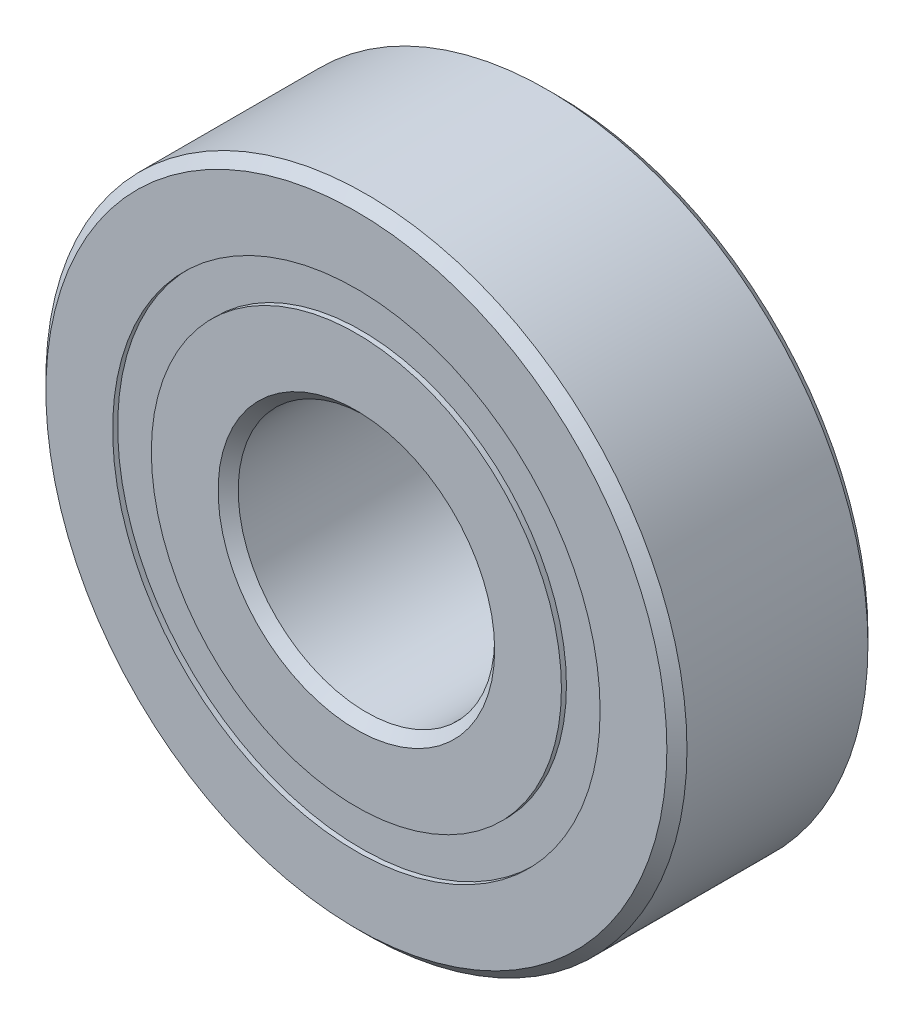
ISO-10303-21;
HEADER;
FILE_DESCRIPTION(('STEP AP214'),'2;1');
FILE_NAME('part.step','',(''),(''),'','','');
FILE_SCHEMA(('AUTOMOTIVE_DESIGN { 1 0 10303 214 1 1 1 1 }'));
ENDSEC;
DATA;
#1=APPLICATION_CONTEXT('core data for automotive mechanical design processes');
#2=APPLICATION_PROTOCOL_DEFINITION('international standard','automotive_design',2000,#1);
#3=PRODUCT_CONTEXT('',#1,'mechanical');
#4=PRODUCT('Part','Part','',(#3));
#5=PRODUCT_RELATED_PRODUCT_CATEGORY('part','',(#4));
#6=PRODUCT_DEFINITION_FORMATION('','',#4);
#7=PRODUCT_DEFINITION_CONTEXT('part definition',#1,'design');
#8=PRODUCT_DEFINITION('design','',#6,#7);
#9=PRODUCT_DEFINITION_SHAPE('','',#8);
#10=(LENGTH_UNIT() NAMED_UNIT(*) SI_UNIT(.MILLI.,.METRE.));
#11=(NAMED_UNIT(*) PLANE_ANGLE_UNIT() SI_UNIT($,.RADIAN.));
#12=(NAMED_UNIT(*) SI_UNIT($,.STERADIAN.) SOLID_ANGLE_UNIT());
#13=UNCERTAINTY_MEASURE_WITH_UNIT(LENGTH_MEASURE(1.E-05),#10,'distance_accuracy_value','');
#14=(GEOMETRIC_REPRESENTATION_CONTEXT(3) GLOBAL_UNCERTAINTY_ASSIGNED_CONTEXT((#13)) GLOBAL_UNIT_ASSIGNED_CONTEXT((#10,
#11,#12)) REPRESENTATION_CONTEXT('',''));
#15=CARTESIAN_POINT('',(0.,0.,0.));
#16=DIRECTION('',(0.,0.,1.));
#17=DIRECTION('',(1.,0.,0.));
#18=AXIS2_PLACEMENT_3D('',#15,#16,#17);
#19=CARTESIAN_POINT('',(0.,6.03522142857143,-2.36474));
#20=DIRECTION('',(0.,0.,1.));
#21=DIRECTION('',(1.,0.,0.));
#22=AXIS2_PLACEMENT_3D('',#19,#20,#21);
#23=PLANE('',#22);
#24=CARTESIAN_POINT('',(0.,0.,-2.36474));
#25=DIRECTION('',(0.,0.,1.));
#26=DIRECTION('',(1.,0.,0.));
#27=AXIS2_PLACEMENT_3D('',#24,#25,#26);
#28=CIRCLE('',#27,6.03522142857143);
#29=CARTESIAN_POINT('',(6.03522142857143,0.,-2.36474));
#30=VERTEX_POINT('',#29);
#31=EDGE_CURVE('E70',#30,#30,#28,.T.);
#32=ORIENTED_EDGE('',*,*,#31,.F.);
#33=EDGE_LOOP('',(#32));
#34=FACE_BOUND('',#33,.T.);
#35=CARTESIAN_POINT('',(0.,0.,-2.36474));
#36=DIRECTION('',(0.,0.,1.));
#37=DIRECTION('',(1.,0.,0.));
#38=AXIS2_PLACEMENT_3D('',#35,#36,#37);
#39=CIRCLE('',#38,5.07727857142857);
#40=CARTESIAN_POINT('',(5.07727857142857,0.,-2.36474));
#41=VERTEX_POINT('',#40);
#42=EDGE_CURVE('E11',#41,#41,#39,.T.);
#43=ORIENTED_EDGE('',*,*,#42,.T.);
#44=EDGE_LOOP('',(#43));
#45=FACE_BOUND('',#44,.T.);
#46=ADVANCED_FACE('F56',(#34,#45),#23,.F.);
#47=CARTESIAN_POINT('',(0.,0.,2.4892));
#48=DIRECTION('',(0.,0.,1.));
#49=DIRECTION('',(1.,0.,0.));
#50=AXIS2_PLACEMENT_3D('',#47,#48,#49);
#51=CYLINDRICAL_SURFACE('',#50,5.07727857142857);
#52=ORIENTED_EDGE('',*,*,#42,.F.);
#53=EDGE_LOOP('',(#52));
#54=FACE_BOUND('',#53,.T.);
#55=CARTESIAN_POINT('',(0.,0.,-1.20554465033679));
#56=DIRECTION('',(0.,0.,1.));
#57=DIRECTION('',(1.,0.,0.));
#58=AXIS2_PLACEMENT_3D('',#55,#56,#57);
#59=CIRCLE('',#58,5.07727857142857);
#60=CARTESIAN_POINT('',(5.07727857142857,0.,-1.20554465033679));
#61=VERTEX_POINT('',#60);
#62=EDGE_CURVE('E62',#61,#61,#59,.T.);
#63=ORIENTED_EDGE('',*,*,#62,.T.);
#64=EDGE_LOOP('',(#63));
#65=FACE_BOUND('',#64,.T.);
#66=ADVANCED_FACE('F79',(#54,#65),#51,.F.);
#67=CARTESIAN_POINT('',(0.,6.03522142857143,-1.20554465033679));
#68=DIRECTION('',(0.,0.,-1.));
#69=DIRECTION('',(-1.,0.,0.));
#70=AXIS2_PLACEMENT_3D('',#67,#68,#69);
#71=PLANE('',#70);
#72=ORIENTED_EDGE('',*,*,#62,.F.);
#73=EDGE_LOOP('',(#72));
#74=FACE_BOUND('',#73,.T.);
#75=CARTESIAN_POINT('',(0.,0.,-1.20554465033679));
#76=DIRECTION('',(0.,0.,1.));
#77=DIRECTION('',(1.,0.,0.));
#78=AXIS2_PLACEMENT_3D('',#75,#76,#77);
#79=CIRCLE('',#78,6.03522142857143);
#80=CARTESIAN_POINT('',(6.03522142857143,0.,-1.20554465033679));
#81=VERTEX_POINT('',#80);
#82=EDGE_CURVE('E66',#81,#81,#79,.T.);
#83=ORIENTED_EDGE('',*,*,#82,.T.);
#84=EDGE_LOOP('',(#83));
#85=FACE_BOUND('',#84,.T.);
#86=ADVANCED_FACE('F83',(#74,#85),#71,.F.);
#87=CARTESIAN_POINT('',(0.,0.,2.4892));
#88=DIRECTION('',(0.,0.,1.));
#89=DIRECTION('',(1.,0.,0.));
#90=AXIS2_PLACEMENT_3D('',#87,#88,#89);
#91=CYLINDRICAL_SURFACE('',#90,6.03522142857143);
#92=ORIENTED_EDGE('',*,*,#82,.F.);
#93=EDGE_LOOP('',(#92));
#94=FACE_BOUND('',#93,.T.);
#95=ORIENTED_EDGE('',*,*,#31,.T.);
#96=EDGE_LOOP('',(#95));
#97=FACE_BOUND('',#96,.T.);
#98=ADVANCED_FACE('F76',(#94,#97),#91,.T.);
#99=CLOSED_SHELL('',(#46,#66,#86,#98));
#100=MANIFOLD_SOLID_BREP('B2',#99);
#101=CARTESIAN_POINT('',(0.,6.03522142857143,2.36474));
#102=DIRECTION('',(0.,0.,-1.));
#103=DIRECTION('',(-1.,0.,0.));
#104=AXIS2_PLACEMENT_3D('',#101,#102,#103);
#105=PLANE('',#104);
#106=CARTESIAN_POINT('',(0.,0.,2.36474));
#107=DIRECTION('',(0.,0.,1.));
#108=DIRECTION('',(1.,0.,0.));
#109=AXIS2_PLACEMENT_3D('',#106,#107,#108);
#110=CIRCLE('',#109,5.07727857142857);
#111=CARTESIAN_POINT('',(5.07727857142857,0.,2.36474));
#112=VERTEX_POINT('',#111);
#113=EDGE_CURVE('E55',#112,#112,#110,.T.);
#114=ORIENTED_EDGE('',*,*,#113,.F.);
#115=EDGE_LOOP('',(#114));
#116=FACE_BOUND('',#115,.T.);
#117=CARTESIAN_POINT('',(0.,0.,2.36474));
#118=DIRECTION('',(0.,0.,1.));
#119=DIRECTION('',(1.,0.,0.));
#120=AXIS2_PLACEMENT_3D('',#117,#118,#119);
#121=CIRCLE('',#120,6.03522142857143);
#122=CARTESIAN_POINT('',(6.03522142857143,0.,2.36474));
#123=VERTEX_POINT('',#122);
#124=EDGE_CURVE('E146',#123,#123,#121,.T.);
#125=ORIENTED_EDGE('',*,*,#124,.T.);
#126=EDGE_LOOP('',(#125));
#127=FACE_BOUND('',#126,.T.);
#128=ADVANCED_FACE('F132',(#116,#127),#105,.F.);
#129=CARTESIAN_POINT('',(0.,0.,2.4892));
#130=DIRECTION('',(0.,0.,1.));
#131=DIRECTION('',(1.,0.,0.));
#132=AXIS2_PLACEMENT_3D('',#129,#130,#131);
#133=CYLINDRICAL_SURFACE('',#132,5.07727857142857);
#134=CARTESIAN_POINT('',(0.,0.,1.20554465033679));
#135=DIRECTION('',(0.,0.,1.));
#136=DIRECTION('',(1.,0.,0.));
#137=AXIS2_PLACEMENT_3D('',#134,#135,#136);
#138=CIRCLE('',#137,5.07727857142857);
#139=CARTESIAN_POINT('',(5.07727857142857,0.,1.20554465033679));
#140=VERTEX_POINT('',#139);
#141=EDGE_CURVE('E138',#140,#140,#138,.T.);
#142=ORIENTED_EDGE('',*,*,#141,.F.);
#143=EDGE_LOOP('',(#142));
#144=FACE_BOUND('',#143,.T.);
#145=ORIENTED_EDGE('',*,*,#113,.T.);
#146=EDGE_LOOP('',(#145));
#147=FACE_BOUND('',#146,.T.);
#148=ADVANCED_FACE('F161',(#144,#147),#133,.F.);
#149=CARTESIAN_POINT('',(0.,6.03522142857143,1.20554465033679));
#150=DIRECTION('',(0.,0.,1.));
#151=DIRECTION('',(1.,0.,0.));
#152=AXIS2_PLACEMENT_3D('',#149,#150,#151);
#153=PLANE('',#152);
#154=CARTESIAN_POINT('',(0.,0.,1.20554465033679));
#155=DIRECTION('',(0.,0.,1.));
#156=DIRECTION('',(1.,0.,0.));
#157=AXIS2_PLACEMENT_3D('',#154,#155,#156);
#158=CIRCLE('',#157,6.03522142857143);
#159=CARTESIAN_POINT('',(6.03522142857143,0.,1.20554465033679));
#160=VERTEX_POINT('',#159);
#161=EDGE_CURVE('E142',#160,#160,#158,.T.);
#162=ORIENTED_EDGE('',*,*,#161,.F.);
#163=EDGE_LOOP('',(#162));
#164=FACE_BOUND('',#163,.T.);
#165=ORIENTED_EDGE('',*,*,#141,.T.);
#166=EDGE_LOOP('',(#165));
#167=FACE_BOUND('',#166,.T.);
#168=ADVANCED_FACE('F156',(#164,#167),#153,.F.);
#169=CARTESIAN_POINT('',(0.,0.,2.4892));
#170=DIRECTION('',(0.,0.,1.));
#171=DIRECTION('',(1.,0.,0.));
#172=AXIS2_PLACEMENT_3D('',#169,#170,#171);
#173=CYLINDRICAL_SURFACE('',#172,6.03522142857143);
#174=ORIENTED_EDGE('',*,*,#124,.F.);
#175=EDGE_LOOP('',(#174));
#176=FACE_BOUND('',#175,.T.);
#177=ORIENTED_EDGE('',*,*,#161,.T.);
#178=EDGE_LOOP('',(#177));
#179=FACE_BOUND('',#178,.T.);
#180=ADVANCED_FACE('F153',(#176,#179),#173,.T.);
#181=CLOSED_SHELL('',(#128,#148,#168,#180));
#182=MANIFOLD_SOLID_BREP('B6',#181);
#183=CARTESIAN_POINT('',(-3.26588180805,4.49510067499584,0.));
#184=DIRECTION('',(0.,0.,1.));
#185=DIRECTION('',(-0.587785252292462,0.809016994374955,0.));
#186=AXIS2_PLACEMENT_3D('',#183,#184,#185);
#187=SPHERICAL_SURFACE('',#186,1.20554465033679);
#188=CARTESIAN_POINT('',(-3.26588180805,4.49510067499584,1.20554465033679));
#189=VERTEX_POINT('',#188);
#190=VERTEX_LOOP('',#189);
#191=FACE_BOUND('',#190,.T.);
#192=ADVANCED_FACE('F208',(#191),#187,.T.);
#193=CLOSED_SHELL('',(#192));
#194=MANIFOLD_SOLID_BREP('B50',#193);
#195=CARTESIAN_POINT('',(-5.28430776866493,1.71697567499586,0.));
#196=DIRECTION('',(0.,0.,1.));
#197=DIRECTION('',(-0.95105651629515,0.309016994374958,0.));
#198=AXIS2_PLACEMENT_3D('',#195,#196,#197);
#199=SPHERICAL_SURFACE('',#198,1.20554465033679);
#200=CARTESIAN_POINT('',(-5.28430776866493,1.71697567499586,1.20554465033679));
#201=VERTEX_POINT('',#200);
#202=VERTEX_LOOP('',#201);
#203=FACE_BOUND('',#202,.T.);
#204=ADVANCED_FACE('F231',(#203),#199,.T.);
#205=CLOSED_SHELL('',(#204));
#206=MANIFOLD_SOLID_BREP('B128',#205);
#207=CARTESIAN_POINT('',(-5.28430776866496,-1.71697567499575,0.));
#208=DIRECTION('',(0.,0.,1.));
#209=DIRECTION('',(-0.951056516295157,-0.309016994374938,0.));
#210=AXIS2_PLACEMENT_3D('',#207,#208,#209);
#211=SPHERICAL_SURFACE('',#210,1.20554465033679);
#212=CARTESIAN_POINT('',(-5.28430776866496,-1.71697567499575,1.20554465033679));
#213=VERTEX_POINT('',#212);
#214=VERTEX_LOOP('',#213);
#215=FACE_BOUND('',#214,.T.);
#216=ADVANCED_FACE('F254',(#215),#211,.T.);
#217=CLOSED_SHELL('',(#216));
#218=MANIFOLD_SOLID_BREP('B204',#217);
#219=CARTESIAN_POINT('',(-3.26588180805009,-4.49510067499577,0.));
#220=DIRECTION('',(0.,0.,1.));
#221=DIRECTION('',(-0.58778525229248,-0.809016994374942,0.));
#222=AXIS2_PLACEMENT_3D('',#219,#220,#221);
#223=SPHERICAL_SURFACE('',#222,1.20554465033679);
#224=CARTESIAN_POINT('',(-3.26588180805009,-4.49510067499577,1.20554465033679));
#225=VERTEX_POINT('',#224);
#226=VERTEX_LOOP('',#225);
#227=FACE_BOUND('',#226,.T.);
#228=ADVANCED_FACE('F277',(#227),#223,.T.);
#229=CLOSED_SHELL('',(#228));
#230=MANIFOLD_SOLID_BREP('B227',#229);
#231=CARTESIAN_POINT('',(0.,-5.55625,0.));
#232=DIRECTION('',(0.,0.,1.));
#233=DIRECTION('',(0.,-1.,0.));
#234=AXIS2_PLACEMENT_3D('',#231,#232,#233);
#235=SPHERICAL_SURFACE('',#234,1.20554465033679);
#236=CARTESIAN_POINT('',(0.,-5.55625,1.20554465033679));
#237=VERTEX_POINT('',#236);
#238=VERTEX_LOOP('',#237);
#239=FACE_BOUND('',#238,.T.);
#240=ADVANCED_FACE('F300',(#239),#235,.T.);
#241=CLOSED_SHELL('',(#240));
#242=MANIFOLD_SOLID_BREP('B250',#241);
#243=CARTESIAN_POINT('',(3.26588180805003,-4.49510067499582,0.));
#244=DIRECTION('',(0.,0.,1.));
#245=DIRECTION('',(0.587785252292469,-0.809016994374951,0.));
#246=AXIS2_PLACEMENT_3D('',#243,#244,#245);
#247=SPHERICAL_SURFACE('',#246,1.20554465033679);
#248=CARTESIAN_POINT('',(3.26588180805003,-4.49510067499582,1.20554465033679));
#249=VERTEX_POINT('',#248);
#250=VERTEX_LOOP('',#249);
#251=FACE_BOUND('',#250,.T.);
#252=ADVANCED_FACE('F323',(#251),#247,.T.);
#253=CLOSED_SHELL('',(#252));
#254=MANIFOLD_SOLID_BREP('B273',#253);
#255=CARTESIAN_POINT('',(5.28430776866494,-1.71697567499582,0.));
#256=DIRECTION('',(0.,0.,1.));
#257=DIRECTION('',(0.951056516295152,-0.309016994374952,0.));
#258=AXIS2_PLACEMENT_3D('',#255,#256,#257);
#259=SPHERICAL_SURFACE('',#258,1.20554465033679);
#260=CARTESIAN_POINT('',(5.28430776866494,-1.71697567499582,1.20554465033679));
#261=VERTEX_POINT('',#260);
#262=VERTEX_LOOP('',#261);
#263=FACE_BOUND('',#262,.T.);
#264=ADVANCED_FACE('F346',(#263),#259,.T.);
#265=CLOSED_SHELL('',(#264));
#266=MANIFOLD_SOLID_BREP('B296',#265);
#267=CARTESIAN_POINT('',(5.28430776866495,1.71697567499579,0.));
#268=DIRECTION('',(0.,0.,1.));
#269=DIRECTION('',(0.951056516295155,0.309016994374945,0.));
#270=AXIS2_PLACEMENT_3D('',#267,#268,#269);
#271=SPHERICAL_SURFACE('',#270,1.20554465033679);
#272=CARTESIAN_POINT('',(5.28430776866495,1.71697567499579,1.20554465033679));
#273=VERTEX_POINT('',#272);
#274=VERTEX_LOOP('',#273);
#275=FACE_BOUND('',#274,.T.);
#276=ADVANCED_FACE('F369',(#275),#271,.T.);
#277=CLOSED_SHELL('',(#276));
#278=MANIFOLD_SOLID_BREP('B319',#277);
#279=CARTESIAN_POINT('',(3.26588180805006,4.4951006749958,0.));
#280=DIRECTION('',(0.,0.,1.));
#281=DIRECTION('',(0.587785252292474,0.809016994374947,0.));
#282=AXIS2_PLACEMENT_3D('',#279,#280,#281);
#283=SPHERICAL_SURFACE('',#282,1.20554465033679);
#284=CARTESIAN_POINT('',(3.26588180805006,4.4951006749958,1.20554465033679));
#285=VERTEX_POINT('',#284);
#286=VERTEX_LOOP('',#285);
#287=FACE_BOUND('',#286,.T.);
#288=ADVANCED_FACE('F392',(#287),#283,.T.);
#289=CLOSED_SHELL('',(#288));
#290=MANIFOLD_SOLID_BREP('B342',#289);
#291=CARTESIAN_POINT('',(0.,5.55625,0.));
#292=DIRECTION('',(0.,0.,1.));
#293=DIRECTION('',(0.,1.,0.));
#294=AXIS2_PLACEMENT_3D('',#291,#292,#293);
#295=SPHERICAL_SURFACE('',#294,1.20554465033679);
#296=CARTESIAN_POINT('',(0.,5.55625,1.20554465033679));
#297=VERTEX_POINT('',#296);
#298=VERTEX_LOOP('',#297);
#299=FACE_BOUND('',#298,.T.);
#300=ADVANCED_FACE('F417',(#299),#295,.T.);
#301=CLOSED_SHELL('',(#300));
#302=MANIFOLD_SOLID_BREP('B365',#301);
#303=CARTESIAN_POINT('',(0.,5.07727857142857,2.4892));
#304=DIRECTION('',(0.,0.,-1.));
#305=DIRECTION('',(-1.,0.,0.));
#306=AXIS2_PLACEMENT_3D('',#303,#304,#305);
#307=PLANE('',#306);
#308=CARTESIAN_POINT('',(0.,0.,2.4892));
#309=DIRECTION('',(0.,0.,1.));
#310=DIRECTION('',(1.,0.,0.));
#311=AXIS2_PLACEMENT_3D('',#308,#309,#310);
#312=CIRCLE('',#311,3.42392);
#313=CARTESIAN_POINT('',(3.42392,0.,2.4892));
#314=VERTEX_POINT('',#313);
#315=EDGE_CURVE('E463',#314,#314,#312,.T.);
#316=ORIENTED_EDGE('',*,*,#315,.F.);
#317=EDGE_LOOP('',(#316));
#318=FACE_BOUND('',#317,.T.);
#319=CARTESIAN_POINT('',(0.,0.,2.4892));
#320=DIRECTION('',(0.,0.,1.));
#321=DIRECTION('',(1.,0.,0.));
#322=AXIS2_PLACEMENT_3D('',#319,#320,#321);
#323=CIRCLE('',#322,5.07727857142857);
#324=CARTESIAN_POINT('',(5.07727857142857,0.,2.4892));
#325=VERTEX_POINT('',#324);
#326=EDGE_CURVE('E416',#325,#325,#323,.T.);
#327=ORIENTED_EDGE('',*,*,#326,.T.);
#328=EDGE_LOOP('',(#327));
#329=FACE_BOUND('',#328,.T.);
#330=ADVANCED_FACE('F435',(#318,#329),#307,.F.);
#331=CARTESIAN_POINT('',(0.,0.,2.4892));
#332=DIRECTION('',(0.,0.,1.));
#333=DIRECTION('',(1.,0.,0.));
#334=AXIS2_PLACEMENT_3D('',#331,#332,#333);
#335=CYLINDRICAL_SURFACE('',#334,5.07727857142857);
#336=ORIENTED_EDGE('',*,*,#326,.F.);
#337=EDGE_LOOP('',(#336));
#338=FACE_BOUND('',#337,.T.);
#339=CARTESIAN_POINT('',(0.,0.,1.10631111111111));
#340=DIRECTION('',(0.,0.,1.));
#341=DIRECTION('',(1.,0.,0.));
#342=AXIS2_PLACEMENT_3D('',#339,#340,#341);
#343=CIRCLE('',#342,5.07727857142857);
#344=CARTESIAN_POINT('',(5.07727857142857,0.,1.10631111111111));
#345=VERTEX_POINT('',#344);
#346=EDGE_CURVE('E441',#345,#345,#343,.T.);
#347=ORIENTED_EDGE('',*,*,#346,.T.);
#348=EDGE_LOOP('',(#347));
#349=FACE_BOUND('',#348,.T.);
#350=ADVANCED_FACE('F470',(#338,#349),#335,.T.);
#351=CARTESIAN_POINT('',(0.,0.,0.));
#352=DIRECTION('',(0.,0.,1.));
#353=DIRECTION('',(1.,0.,0.));
#354=AXIS2_PLACEMENT_3D('',#351,#352,#353);
#355=TOROIDAL_SURFACE('',#354,5.55625,1.20554465033679);
#356=ORIENTED_EDGE('',*,*,#346,.F.);
#357=EDGE_LOOP('',(#356));
#358=FACE_BOUND('',#357,.T.);
#359=CARTESIAN_POINT('',(0.,0.,-1.10631111111111));
#360=DIRECTION('',(0.,0.,1.));
#361=DIRECTION('',(1.,0.,0.));
#362=AXIS2_PLACEMENT_3D('',#359,#360,#361);
#363=CIRCLE('',#362,5.07727857142857);
#364=CARTESIAN_POINT('',(5.07727857142857,0.,-1.10631111111111));
#365=VERTEX_POINT('',#364);
#366=EDGE_CURVE('E445',#365,#365,#363,.T.);
#367=ORIENTED_EDGE('',*,*,#366,.T.);
#368=EDGE_LOOP('',(#367));
#369=FACE_BOUND('',#368,.T.);
#370=ADVANCED_FACE('F474',(#358,#369),#355,.F.);
#371=CARTESIAN_POINT('',(0.,0.,2.4892));
#372=DIRECTION('',(0.,0.,1.));
#373=DIRECTION('',(1.,0.,0.));
#374=AXIS2_PLACEMENT_3D('',#371,#372,#373);
#375=CYLINDRICAL_SURFACE('',#374,5.07727857142857);
#376=ORIENTED_EDGE('',*,*,#366,.F.);
#377=EDGE_LOOP('',(#376));
#378=FACE_BOUND('',#377,.T.);
#379=CARTESIAN_POINT('',(0.,0.,-2.4892));
#380=DIRECTION('',(0.,0.,1.));
#381=DIRECTION('',(1.,0.,0.));
#382=AXIS2_PLACEMENT_3D('',#379,#380,#381);
#383=CIRCLE('',#382,5.07727857142857);
#384=CARTESIAN_POINT('',(5.07727857142857,0.,-2.4892));
#385=VERTEX_POINT('',#384);
#386=EDGE_CURVE('E449',#385,#385,#383,.T.);
#387=ORIENTED_EDGE('',*,*,#386,.T.);
#388=EDGE_LOOP('',(#387));
#389=FACE_BOUND('',#388,.T.);
#390=ADVANCED_FACE('F479',(#378,#389),#375,.T.);
#391=CARTESIAN_POINT('',(0.,3.42392,-2.4892));
#392=DIRECTION('',(0.,0.,1.));
#393=DIRECTION('',(1.,0.,0.));
#394=AXIS2_PLACEMENT_3D('',#391,#392,#393);
#395=PLANE('',#394);
#396=ORIENTED_EDGE('',*,*,#386,.F.);
#397=EDGE_LOOP('',(#396));
#398=FACE_BOUND('',#397,.T.);
#399=CARTESIAN_POINT('',(0.,0.,-2.4892));
#400=DIRECTION('',(0.,0.,1.));
#401=DIRECTION('',(1.,0.,0.));
#402=AXIS2_PLACEMENT_3D('',#399,#400,#401);
#403=CIRCLE('',#402,3.42392);
#404=CARTESIAN_POINT('',(3.42392,0.,-2.4892));
#405=VERTEX_POINT('',#404);
#406=EDGE_CURVE('E454',#405,#405,#403,.T.);
#407=ORIENTED_EDGE('',*,*,#406,.T.);
#408=EDGE_LOOP('',(#407));
#409=FACE_BOUND('',#408,.T.);
#410=ADVANCED_FACE('F485',(#398,#409),#395,.F.);
#411=CARTESIAN_POINT('',(0.,0.,-2.24028));
#412=DIRECTION('',(0.,0.,-1.));
#413=DIRECTION('',(-1.,0.,0.));
#414=AXIS2_PLACEMENT_3D('',#411,#412,#413);
#415=CONICAL_SURFACE('',#414,3.175,0.785398163397446);
#416=ORIENTED_EDGE('',*,*,#406,.F.);
#417=EDGE_LOOP('',(#416));
#418=FACE_BOUND('',#417,.T.);
#419=CARTESIAN_POINT('',(0.,0.,-2.24028));
#420=DIRECTION('',(0.,0.,1.));
#421=DIRECTION('',(1.,0.,0.));
#422=AXIS2_PLACEMENT_3D('',#419,#420,#421);
#423=CIRCLE('',#422,3.175);
#424=CARTESIAN_POINT('',(3.175,0.,-2.24028));
#425=VERTEX_POINT('',#424);
#426=EDGE_CURVE('E457',#425,#425,#423,.T.);
#427=ORIENTED_EDGE('',*,*,#426,.T.);
#428=EDGE_LOOP('',(#427));
#429=FACE_BOUND('',#428,.T.);
#430=ADVANCED_FACE('F489',(#418,#429),#415,.F.);
#431=CARTESIAN_POINT('',(0.,0.,2.4892));
#432=DIRECTION('',(0.,0.,1.));
#433=DIRECTION('',(1.,0.,0.));
#434=AXIS2_PLACEMENT_3D('',#431,#432,#433);
#435=CYLINDRICAL_SURFACE('',#434,3.175);
#436=ORIENTED_EDGE('',*,*,#426,.F.);
#437=EDGE_LOOP('',(#436));
#438=FACE_BOUND('',#437,.T.);
#439=CARTESIAN_POINT('',(0.,0.,2.24028));
#440=DIRECTION('',(0.,0.,1.));
#441=DIRECTION('',(1.,0.,0.));
#442=AXIS2_PLACEMENT_3D('',#439,#440,#441);
#443=CIRCLE('',#442,3.175);
#444=CARTESIAN_POINT('',(3.175,0.,2.24028));
#445=VERTEX_POINT('',#444);
#446=EDGE_CURVE('E460',#445,#445,#443,.T.);
#447=ORIENTED_EDGE('',*,*,#446,.T.);
#448=EDGE_LOOP('',(#447));
#449=FACE_BOUND('',#448,.T.);
#450=ADVANCED_FACE('F493',(#438,#449),#435,.F.);
#451=CARTESIAN_POINT('',(0.,0.,2.4892));
#452=DIRECTION('',(0.,0.,1.));
#453=DIRECTION('',(1.,0.,0.));
#454=AXIS2_PLACEMENT_3D('',#451,#452,#453);
#455=CONICAL_SURFACE('',#454,3.42392,0.785398163397449);
#456=ORIENTED_EDGE('',*,*,#446,.F.);
#457=EDGE_LOOP('',(#456));
#458=FACE_BOUND('',#457,.T.);
#459=ORIENTED_EDGE('',*,*,#315,.T.);
#460=EDGE_LOOP('',(#459));
#461=FACE_BOUND('',#460,.T.);
#462=ADVANCED_FACE('F467',(#458,#461),#455,.F.);
#463=CLOSED_SHELL('',(#330,#350,#370,#390,#410,#430,#450,#462));
#464=MANIFOLD_SOLID_BREP('B388',#463);
#465=CARTESIAN_POINT('',(0.,0.,2.24028));
#466=DIRECTION('',(0.,0.,-1.));
#467=DIRECTION('',(-1.,0.,0.));
#468=AXIS2_PLACEMENT_3D('',#465,#466,#467);
#469=CONICAL_SURFACE('',#468,7.9375,0.785398163397446);
#470=CARTESIAN_POINT('',(0.,0.,2.4892));
#471=DIRECTION('',(0.,0.,1.));
#472=DIRECTION('',(1.,0.,0.));
#473=AXIS2_PLACEMENT_3D('',#470,#471,#472);
#474=CIRCLE('',#473,7.68858);
#475=CARTESIAN_POINT('',(7.68858,0.,2.4892));
#476=VERTEX_POINT('',#475);
#477=EDGE_CURVE('E576',#476,#476,#474,.T.);
#478=ORIENTED_EDGE('',*,*,#477,.F.);
#479=EDGE_LOOP('',(#478));
#480=FACE_BOUND('',#479,.T.);
#481=CARTESIAN_POINT('',(0.,0.,2.24028));
#482=DIRECTION('',(0.,0.,1.));
#483=DIRECTION('',(1.,0.,0.));
#484=AXIS2_PLACEMENT_3D('',#481,#482,#483);
#485=CIRCLE('',#484,7.9375);
#486=CARTESIAN_POINT('',(7.9375,0.,2.24028));
#487=VERTEX_POINT('',#486);
#488=EDGE_CURVE('E434',#487,#487,#485,.T.);
#489=ORIENTED_EDGE('',*,*,#488,.T.);
#490=EDGE_LOOP('',(#489));
#491=FACE_BOUND('',#490,.T.);
#492=ADVANCED_FACE('F541',(#480,#491),#469,.T.);
#493=CARTESIAN_POINT('',(0.,0.,2.4892));
#494=DIRECTION('',(0.,0.,1.));
#495=DIRECTION('',(1.,0.,0.));
#496=AXIS2_PLACEMENT_3D('',#493,#494,#495);
#497=CYLINDRICAL_SURFACE('',#496,7.9375);
#498=ORIENTED_EDGE('',*,*,#488,.F.);
#499=EDGE_LOOP('',(#498));
#500=FACE_BOUND('',#499,.T.);
#501=CARTESIAN_POINT('',(0.,0.,-2.24028));
#502=DIRECTION('',(0.,0.,1.));
#503=DIRECTION('',(1.,0.,0.));
#504=AXIS2_PLACEMENT_3D('',#501,#502,#503);
#505=CIRCLE('',#504,7.9375);
#506=CARTESIAN_POINT('',(7.9375,0.,-2.24028));
#507=VERTEX_POINT('',#506);
#508=EDGE_CURVE('E548',#507,#507,#505,.T.);
#509=ORIENTED_EDGE('',*,*,#508,.T.);
#510=EDGE_LOOP('',(#509));
#511=FACE_BOUND('',#510,.T.);
#512=ADVANCED_FACE('F584',(#500,#511),#497,.T.);
#513=CARTESIAN_POINT('',(0.,0.,-2.4892));
#514=DIRECTION('',(0.,0.,1.));
#515=DIRECTION('',(1.,0.,0.));
#516=AXIS2_PLACEMENT_3D('',#513,#514,#515);
#517=CONICAL_SURFACE('',#516,7.68858,0.785398163397445);
#518=ORIENTED_EDGE('',*,*,#508,.F.);
#519=EDGE_LOOP('',(#518));
#520=FACE_BOUND('',#519,.T.);
#521=CARTESIAN_POINT('',(0.,0.,-2.4892));
#522=DIRECTION('',(0.,0.,1.));
#523=DIRECTION('',(1.,0.,0.));
#524=AXIS2_PLACEMENT_3D('',#521,#522,#523);
#525=CIRCLE('',#524,7.68858);
#526=CARTESIAN_POINT('',(7.68858,0.,-2.4892));
#527=VERTEX_POINT('',#526);
#528=EDGE_CURVE('E553',#527,#527,#525,.T.);
#529=ORIENTED_EDGE('',*,*,#528,.T.);
#530=EDGE_LOOP('',(#529));
#531=FACE_BOUND('',#530,.T.);
#532=ADVANCED_FACE('F588',(#520,#531),#517,.T.);
#533=CARTESIAN_POINT('',(0.,7.68858,-2.4892));
#534=DIRECTION('',(0.,0.,1.));
#535=DIRECTION('',(1.,0.,0.));
#536=AXIS2_PLACEMENT_3D('',#533,#534,#535);
#537=PLANE('',#536);
#538=ORIENTED_EDGE('',*,*,#528,.F.);
#539=EDGE_LOOP('',(#538));
#540=FACE_BOUND('',#539,.T.);
#541=CARTESIAN_POINT('',(0.,0.,-2.4892));
#542=DIRECTION('',(0.,0.,1.));
#543=DIRECTION('',(1.,0.,0.));
#544=AXIS2_PLACEMENT_3D('',#541,#542,#543);
#545=CIRCLE('',#544,6.03522142857143);
#546=CARTESIAN_POINT('',(6.03522142857143,0.,-2.4892));
#547=VERTEX_POINT('',#546);
#548=EDGE_CURVE('E558',#547,#547,#545,.T.);
#549=ORIENTED_EDGE('',*,*,#548,.T.);
#550=EDGE_LOOP('',(#549));
#551=FACE_BOUND('',#550,.T.);
#552=ADVANCED_FACE('F593',(#540,#551),#537,.F.);
#553=CARTESIAN_POINT('',(0.,0.,2.4892));
#554=DIRECTION('',(0.,0.,1.));
#555=DIRECTION('',(1.,0.,0.));
#556=AXIS2_PLACEMENT_3D('',#553,#554,#555);
#557=CYLINDRICAL_SURFACE('',#556,6.03522142857143);
#558=ORIENTED_EDGE('',*,*,#548,.F.);
#559=EDGE_LOOP('',(#558));
#560=FACE_BOUND('',#559,.T.);
#561=CARTESIAN_POINT('',(0.,0.,-1.10631111111111));
#562=DIRECTION('',(0.,0.,1.));
#563=DIRECTION('',(1.,0.,0.));
#564=AXIS2_PLACEMENT_3D('',#561,#562,#563);
#565=CIRCLE('',#564,6.03522142857143);
#566=CARTESIAN_POINT('',(6.03522142857143,0.,-1.10631111111111));
#567=VERTEX_POINT('',#566);
#568=EDGE_CURVE('E564',#567,#567,#565,.T.);
#569=ORIENTED_EDGE('',*,*,#568,.T.);
#570=EDGE_LOOP('',(#569));
#571=FACE_BOUND('',#570,.T.);
#572=ADVANCED_FACE('F599',(#560,#571),#557,.F.);
#573=CARTESIAN_POINT('',(0.,0.,0.));
#574=DIRECTION('',(0.,0.,1.));
#575=DIRECTION('',(1.,0.,0.));
#576=AXIS2_PLACEMENT_3D('',#573,#574,#575);
#577=TOROIDAL_SURFACE('',#576,5.55625,1.20554465033679);
#578=ORIENTED_EDGE('',*,*,#568,.F.);
#579=EDGE_LOOP('',(#578));
#580=FACE_BOUND('',#579,.T.);
#581=CARTESIAN_POINT('',(0.,0.,1.10631111111111));
#582=DIRECTION('',(0.,0.,1.));
#583=DIRECTION('',(1.,0.,0.));
#584=AXIS2_PLACEMENT_3D('',#581,#582,#583);
#585=CIRCLE('',#584,6.03522142857143);
#586=CARTESIAN_POINT('',(6.03522142857143,0.,1.10631111111111));
#587=VERTEX_POINT('',#586);
#588=EDGE_CURVE('E568',#587,#587,#585,.T.);
#589=ORIENTED_EDGE('',*,*,#588,.T.);
#590=EDGE_LOOP('',(#589));
#591=FACE_BOUND('',#590,.T.);
#592=ADVANCED_FACE('F603',(#580,#591),#577,.F.);
#593=CARTESIAN_POINT('',(0.,0.,2.4892));
#594=DIRECTION('',(0.,0.,1.));
#595=DIRECTION('',(1.,0.,0.));
#596=AXIS2_PLACEMENT_3D('',#593,#594,#595);
#597=CYLINDRICAL_SURFACE('',#596,6.03522142857143);
#598=ORIENTED_EDGE('',*,*,#588,.F.);
#599=EDGE_LOOP('',(#598));
#600=FACE_BOUND('',#599,.T.);
#601=CARTESIAN_POINT('',(0.,0.,2.4892));
#602=DIRECTION('',(0.,0.,1.));
#603=DIRECTION('',(1.,0.,0.));
#604=AXIS2_PLACEMENT_3D('',#601,#602,#603);
#605=CIRCLE('',#604,6.03522142857143);
#606=CARTESIAN_POINT('',(6.03522142857143,0.,2.4892));
#607=VERTEX_POINT('',#606);
#608=EDGE_CURVE('E572',#607,#607,#605,.T.);
#609=ORIENTED_EDGE('',*,*,#608,.T.);
#610=EDGE_LOOP('',(#609));
#611=FACE_BOUND('',#610,.T.);
#612=ADVANCED_FACE('F607',(#600,#611),#597,.F.);
#613=CARTESIAN_POINT('',(0.,7.68858,2.4892));
#614=DIRECTION('',(0.,0.,-1.));
#615=DIRECTION('',(-1.,0.,0.));
#616=AXIS2_PLACEMENT_3D('',#613,#614,#615);
#617=PLANE('',#616);
#618=ORIENTED_EDGE('',*,*,#608,.F.);
#619=EDGE_LOOP('',(#618));
#620=FACE_BOUND('',#619,.T.);
#621=ORIENTED_EDGE('',*,*,#477,.T.);
#622=EDGE_LOOP('',(#621));
#623=FACE_BOUND('',#622,.T.);
#624=ADVANCED_FACE('F581',(#620,#623),#617,.F.);
#625=CLOSED_SHELL('',(#492,#512,#532,#552,#572,#592,#612,#624));
#626=MANIFOLD_SOLID_BREP('B411',#625);
#627=ADVANCED_BREP_SHAPE_REPRESENTATION('',(#18,#100,#182,#194,#206,#218,#230,#242,#254,#266,
#278,#290,#302,#464,#626),#14);
#628=SHAPE_DEFINITION_REPRESENTATION(#9,#627);
ENDSEC;
END-ISO-10303-21;
